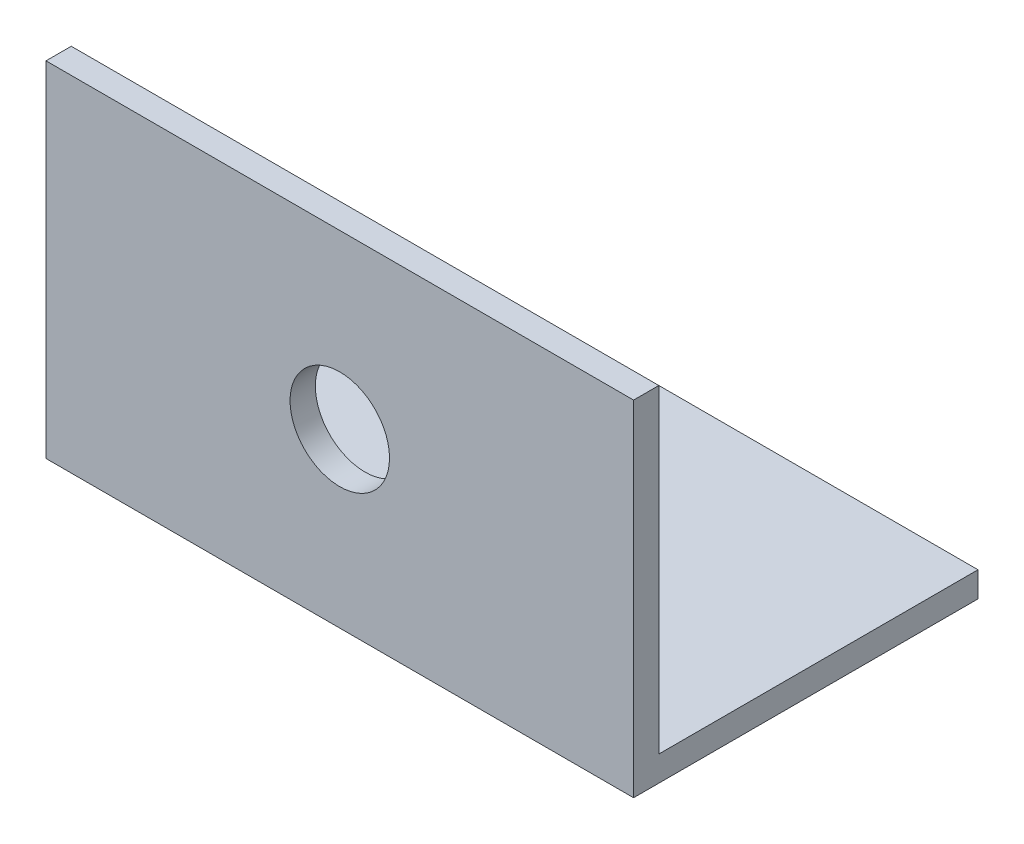
ISO-10303-21;
HEADER;
FILE_DESCRIPTION(('STEP AP214'),'2;1');
FILE_NAME('part.step','',(''),(''),'','','');
FILE_SCHEMA(('AUTOMOTIVE_DESIGN { 1 0 10303 214 1 1 1 1 }'));
ENDSEC;
DATA;
#1=APPLICATION_CONTEXT('core data for automotive mechanical design processes');
#2=APPLICATION_PROTOCOL_DEFINITION('international standard','automotive_design',2000,#1);
#3=PRODUCT_CONTEXT('',#1,'mechanical');
#4=PRODUCT('Part','Part','',(#3));
#5=PRODUCT_RELATED_PRODUCT_CATEGORY('part','',(#4));
#6=PRODUCT_DEFINITION_FORMATION('','',#4);
#7=PRODUCT_DEFINITION_CONTEXT('part definition',#1,'design');
#8=PRODUCT_DEFINITION('design','',#6,#7);
#9=PRODUCT_DEFINITION_SHAPE('','',#8);
#10=(LENGTH_UNIT() NAMED_UNIT(*) SI_UNIT(.MILLI.,.METRE.));
#11=(NAMED_UNIT(*) PLANE_ANGLE_UNIT() SI_UNIT($,.RADIAN.));
#12=(NAMED_UNIT(*) SI_UNIT($,.STERADIAN.) SOLID_ANGLE_UNIT());
#13=UNCERTAINTY_MEASURE_WITH_UNIT(LENGTH_MEASURE(1.E-05),#10,'distance_accuracy_value','');
#14=(GEOMETRIC_REPRESENTATION_CONTEXT(3) GLOBAL_UNCERTAINTY_ASSIGNED_CONTEXT((#13)) GLOBAL_UNIT_ASSIGNED_CONTEXT((#10,
#11,#12)) REPRESENTATION_CONTEXT('',''));
#15=CARTESIAN_POINT('',(0.,0.,0.));
#16=DIRECTION('',(0.,0.,1.));
#17=DIRECTION('',(1.,0.,0.));
#18=AXIS2_PLACEMENT_3D('',#15,#16,#17);
#19=CARTESIAN_POINT('',(65.,35.306,0.));
#20=DIRECTION('',(0.,-1.,0.));
#21=DIRECTION('',(0.,0.,-1.));
#22=AXIS2_PLACEMENT_3D('',#19,#20,#21);
#23=PLANE('',#22);
#24=DIRECTION('',(0.,0.,1.));
#25=VECTOR('',#24,1.);
#26=CARTESIAN_POINT('',(0.,35.306,0.));
#27=LINE('',#26,#25);
#28=CARTESIAN_POINT('',(0.,35.306,0.));
#29=VERTEX_POINT('',#28);
#30=CARTESIAN_POINT('',(0.,35.306,2.794));
#31=VERTEX_POINT('',#30);
#32=EDGE_CURVE('E117',#29,#31,#27,.T.);
#33=ORIENTED_EDGE('',*,*,#32,.T.);
#34=DIRECTION('',(-1.,0.,0.));
#35=VECTOR('',#34,1.);
#36=CARTESIAN_POINT('',(65.,35.306,2.794));
#37=LINE('',#36,#35);
#38=CARTESIAN_POINT('',(65.,35.306,2.794));
#39=VERTEX_POINT('',#38);
#40=EDGE_CURVE('E11',#39,#31,#37,.T.);
#41=ORIENTED_EDGE('',*,*,#40,.F.);
#42=DIRECTION('',(0.,0.,1.));
#43=VECTOR('',#42,1.);
#44=CARTESIAN_POINT('',(65.,35.306,0.));
#45=LINE('',#44,#43);
#46=CARTESIAN_POINT('',(65.,35.306,0.));
#47=VERTEX_POINT('',#46);
#48=EDGE_CURVE('E127',#47,#39,#45,.T.);
#49=ORIENTED_EDGE('',*,*,#48,.F.);
#50=DIRECTION('',(-1.,0.,0.));
#51=VECTOR('',#50,1.);
#52=CARTESIAN_POINT('',(65.,35.306,0.));
#53=LINE('',#52,#51);
#54=EDGE_CURVE('E113',#47,#29,#53,.T.);
#55=ORIENTED_EDGE('',*,*,#54,.T.);
#56=EDGE_LOOP('',(#33,#41,#49,#55));
#57=FACE_BOUND('',#56,.T.);
#58=ADVANCED_FACE('F32',(#57),#23,.F.);
#59=CARTESIAN_POINT('',(65.,-2.794,2.794));
#60=DIRECTION('',(0.,0.,-1.));
#61=DIRECTION('',(-1.,0.,0.));
#62=AXIS2_PLACEMENT_3D('',#59,#60,#61);
#63=PLANE('',#62);
#64=CARTESIAN_POINT('',(32.5,16.256,2.794));
#65=DIRECTION('',(0.,0.,1.));
#66=DIRECTION('',(1.,0.,0.));
#67=AXIS2_PLACEMENT_3D('',#64,#65,#66);
#68=CIRCLE('',#67,5.5);
#69=CARTESIAN_POINT('',(38.,16.256,2.794));
#70=VERTEX_POINT('',#69);
#71=EDGE_CURVE('E205',#70,#70,#68,.T.);
#72=ORIENTED_EDGE('',*,*,#71,.F.);
#73=EDGE_LOOP('',(#72));
#74=FACE_BOUND('',#73,.T.);
#75=DIRECTION('',(0.,-1.,0.));
#76=VECTOR('',#75,1.);
#77=CARTESIAN_POINT('',(0.,-2.794,2.794));
#78=LINE('',#77,#76);
#79=CARTESIAN_POINT('',(0.,-2.794,2.794));
#80=VERTEX_POINT('',#79);
#81=EDGE_CURVE('E120',#31,#80,#78,.T.);
#82=ORIENTED_EDGE('',*,*,#81,.T.);
#83=DIRECTION('',(-1.,0.,0.));
#84=VECTOR('',#83,1.);
#85=CARTESIAN_POINT('',(65.,-2.794,2.794));
#86=LINE('',#85,#84);
#87=CARTESIAN_POINT('',(65.,-2.794,2.794));
#88=VERTEX_POINT('',#87);
#89=EDGE_CURVE('E41',#88,#80,#86,.T.);
#90=ORIENTED_EDGE('',*,*,#89,.F.);
#91=DIRECTION('',(0.,-1.,0.));
#92=VECTOR('',#91,1.);
#93=CARTESIAN_POINT('',(65.,-2.794,2.794));
#94=LINE('',#93,#92);
#95=EDGE_CURVE('E86',#39,#88,#94,.T.);
#96=ORIENTED_EDGE('',*,*,#95,.F.);
#97=ORIENTED_EDGE('',*,*,#40,.T.);
#98=EDGE_LOOP('',(#82,#90,#96,#97));
#99=FACE_BOUND('',#98,.T.);
#100=ADVANCED_FACE('F156',(#74,#99),#63,.F.);
#101=CARTESIAN_POINT('',(65.,-2.794,-35.306));
#102=DIRECTION('',(0.,1.,0.));
#103=DIRECTION('',(0.,0.,1.));
#104=AXIS2_PLACEMENT_3D('',#101,#102,#103);
#105=PLANE('',#104);
#106=DIRECTION('',(0.,0.,-1.));
#107=VECTOR('',#106,1.);
#108=CARTESIAN_POINT('',(0.,-2.794,-35.306));
#109=LINE('',#108,#107);
#110=CARTESIAN_POINT('',(0.,-2.794,-35.306));
#111=VERTEX_POINT('',#110);
#112=EDGE_CURVE('E122',#80,#111,#109,.T.);
#113=ORIENTED_EDGE('',*,*,#112,.T.);
#114=DIRECTION('',(-1.,0.,0.));
#115=VECTOR('',#114,1.);
#116=CARTESIAN_POINT('',(65.,-2.794,-35.306));
#117=LINE('',#116,#115);
#118=CARTESIAN_POINT('',(65.,-2.794,-35.306));
#119=VERTEX_POINT('',#118);
#120=EDGE_CURVE('E108',#119,#111,#117,.T.);
#121=ORIENTED_EDGE('',*,*,#120,.F.);
#122=DIRECTION('',(0.,0.,-1.));
#123=VECTOR('',#122,1.);
#124=CARTESIAN_POINT('',(65.,-2.794,-35.306));
#125=LINE('',#124,#123);
#126=EDGE_CURVE('E99',#88,#119,#125,.T.);
#127=ORIENTED_EDGE('',*,*,#126,.F.);
#128=ORIENTED_EDGE('',*,*,#89,.T.);
#129=EDGE_LOOP('',(#113,#121,#127,#128));
#130=FACE_BOUND('',#129,.T.);
#131=ADVANCED_FACE('F134',(#130),#105,.F.);
#132=CARTESIAN_POINT('',(65.,0.,-35.306));
#133=DIRECTION('',(0.,0.,1.));
#134=DIRECTION('',(1.,0.,0.));
#135=AXIS2_PLACEMENT_3D('',#132,#133,#134);
#136=PLANE('',#135);
#137=DIRECTION('',(0.,1.,0.));
#138=VECTOR('',#137,1.);
#139=CARTESIAN_POINT('',(0.,0.,-35.306));
#140=LINE('',#139,#138);
#141=CARTESIAN_POINT('',(0.,0.,-35.306));
#142=VERTEX_POINT('',#141);
#143=EDGE_CURVE('E107',#111,#142,#140,.T.);
#144=ORIENTED_EDGE('',*,*,#143,.T.);
#145=DIRECTION('',(-1.,0.,0.));
#146=VECTOR('',#145,1.);
#147=CARTESIAN_POINT('',(65.,0.,-35.306));
#148=LINE('',#147,#146);
#149=CARTESIAN_POINT('',(65.,0.,-35.306));
#150=VERTEX_POINT('',#149);
#151=EDGE_CURVE('E104',#150,#142,#148,.T.);
#152=ORIENTED_EDGE('',*,*,#151,.F.);
#153=DIRECTION('',(0.,1.,0.));
#154=VECTOR('',#153,1.);
#155=CARTESIAN_POINT('',(65.,0.,-35.306));
#156=LINE('',#155,#154);
#157=EDGE_CURVE('E93',#119,#150,#156,.T.);
#158=ORIENTED_EDGE('',*,*,#157,.F.);
#159=ORIENTED_EDGE('',*,*,#120,.T.);
#160=EDGE_LOOP('',(#144,#152,#158,#159));
#161=FACE_BOUND('',#160,.T.);
#162=ADVANCED_FACE('F105',(#161),#136,.F.);
#163=CARTESIAN_POINT('',(65.,0.,0.));
#164=DIRECTION('',(0.,-1.,0.));
#165=DIRECTION('',(0.,0.,-1.));
#166=AXIS2_PLACEMENT_3D('',#163,#164,#165);
#167=PLANE('',#166);
#168=DIRECTION('',(0.,0.,1.));
#169=VECTOR('',#168,1.);
#170=CARTESIAN_POINT('',(0.,0.,0.));
#171=LINE('',#170,#169);
#172=CARTESIAN_POINT('',(0.,0.,0.));
#173=VERTEX_POINT('',#172);
#174=EDGE_CURVE('E72',#142,#173,#171,.T.);
#175=ORIENTED_EDGE('',*,*,#174,.T.);
#176=DIRECTION('',(-1.,0.,0.));
#177=VECTOR('',#176,1.);
#178=CARTESIAN_POINT('',(65.,0.,0.));
#179=LINE('',#178,#177);
#180=CARTESIAN_POINT('',(65.,0.,0.));
#181=VERTEX_POINT('',#180);
#182=EDGE_CURVE('E109',#181,#173,#179,.T.);
#183=ORIENTED_EDGE('',*,*,#182,.F.);
#184=DIRECTION('',(0.,0.,1.));
#185=VECTOR('',#184,1.);
#186=CARTESIAN_POINT('',(65.,0.,0.));
#187=LINE('',#186,#185);
#188=EDGE_CURVE('E97',#150,#181,#187,.T.);
#189=ORIENTED_EDGE('',*,*,#188,.F.);
#190=ORIENTED_EDGE('',*,*,#151,.T.);
#191=EDGE_LOOP('',(#175,#183,#189,#190));
#192=FACE_BOUND('',#191,.T.);
#193=ADVANCED_FACE('F111',(#192),#167,.F.);
#194=CARTESIAN_POINT('',(65.,35.306,0.));
#195=DIRECTION('',(0.,0.,1.));
#196=DIRECTION('',(0.,-1.,0.));
#197=AXIS2_PLACEMENT_3D('',#194,#195,#196);
#198=PLANE('',#197);
#199=CARTESIAN_POINT('',(32.5,16.256,0.));
#200=DIRECTION('',(0.,0.,1.));
#201=DIRECTION('',(0.,-1.,0.));
#202=AXIS2_PLACEMENT_3D('',#199,#200,#201);
#203=CIRCLE('',#202,5.5);
#204=CARTESIAN_POINT('',(32.5,10.756,0.));
#205=VERTEX_POINT('',#204);
#206=EDGE_CURVE('E35',#205,#205,#203,.T.);
#207=ORIENTED_EDGE('',*,*,#206,.T.);
#208=EDGE_LOOP('',(#207));
#209=FACE_BOUND('',#208,.T.);
#210=DIRECTION('',(0.,1.,0.));
#211=VECTOR('',#210,1.);
#212=CARTESIAN_POINT('',(0.,35.306,0.));
#213=LINE('',#212,#211);
#214=EDGE_CURVE('E78',#173,#29,#213,.T.);
#215=ORIENTED_EDGE('',*,*,#214,.T.);
#216=ORIENTED_EDGE('',*,*,#54,.F.);
#217=DIRECTION('',(0.,1.,0.));
#218=VECTOR('',#217,1.);
#219=CARTESIAN_POINT('',(65.,35.306,0.));
#220=LINE('',#219,#218);
#221=EDGE_CURVE('E49',#181,#47,#220,.T.);
#222=ORIENTED_EDGE('',*,*,#221,.F.);
#223=ORIENTED_EDGE('',*,*,#182,.T.);
#224=EDGE_LOOP('',(#215,#216,#222,#223));
#225=FACE_BOUND('',#224,.T.);
#226=ADVANCED_FACE('F141',(#209,#225),#198,.F.);
#227=CARTESIAN_POINT('',(65.,0.,0.));
#228=DIRECTION('',(-1.,0.,0.));
#229=DIRECTION('',(0.,0.,1.));
#230=AXIS2_PLACEMENT_3D('',#227,#228,#229);
#231=PLANE('',#230);
#232=ORIENTED_EDGE('',*,*,#48,.T.);
#233=ORIENTED_EDGE('',*,*,#95,.T.);
#234=ORIENTED_EDGE('',*,*,#126,.T.);
#235=ORIENTED_EDGE('',*,*,#157,.T.);
#236=ORIENTED_EDGE('',*,*,#188,.T.);
#237=ORIENTED_EDGE('',*,*,#221,.T.);
#238=EDGE_LOOP('',(#232,#233,#234,#235,#236,#237));
#239=FACE_BOUND('',#238,.T.);
#240=ADVANCED_FACE('F95',(#239),#231,.F.);
#241=CARTESIAN_POINT('',(0.,0.,0.));
#242=DIRECTION('',(-1.,0.,0.));
#243=DIRECTION('',(0.,0.,1.));
#244=AXIS2_PLACEMENT_3D('',#241,#242,#243);
#245=PLANE('',#244);
#246=ORIENTED_EDGE('',*,*,#32,.F.);
#247=ORIENTED_EDGE('',*,*,#214,.F.);
#248=ORIENTED_EDGE('',*,*,#174,.F.);
#249=ORIENTED_EDGE('',*,*,#143,.F.);
#250=ORIENTED_EDGE('',*,*,#112,.F.);
#251=ORIENTED_EDGE('',*,*,#81,.F.);
#252=EDGE_LOOP('',(#246,#247,#248,#249,#250,#251));
#253=FACE_BOUND('',#252,.T.);
#254=ADVANCED_FACE('F137',(#253),#245,.T.);
#255=CARTESIAN_POINT('',(32.5,16.256,-62.206));
#256=DIRECTION('',(0.,0.,1.));
#257=DIRECTION('',(1.,0.,0.));
#258=AXIS2_PLACEMENT_3D('',#255,#256,#257);
#259=CYLINDRICAL_SURFACE('',#258,5.5);
#260=ORIENTED_EDGE('',*,*,#71,.T.);
#261=EDGE_LOOP('',(#260));
#262=FACE_BOUND('',#261,.T.);
#263=ORIENTED_EDGE('',*,*,#206,.F.);
#264=EDGE_LOOP('',(#263));
#265=FACE_BOUND('',#264,.T.);
#266=ADVANCED_FACE('F189',(#262,#265),#259,.F.);
#267=CLOSED_SHELL('',(#58,#100,#131,#162,#193,#226,#240,#254,#266));
#268=MANIFOLD_SOLID_BREP('B2',#267);
#269=ADVANCED_BREP_SHAPE_REPRESENTATION('',(#18,#268),#14);
#270=SHAPE_DEFINITION_REPRESENTATION(#9,#269);
ENDSEC;
END-ISO-10303-21;
